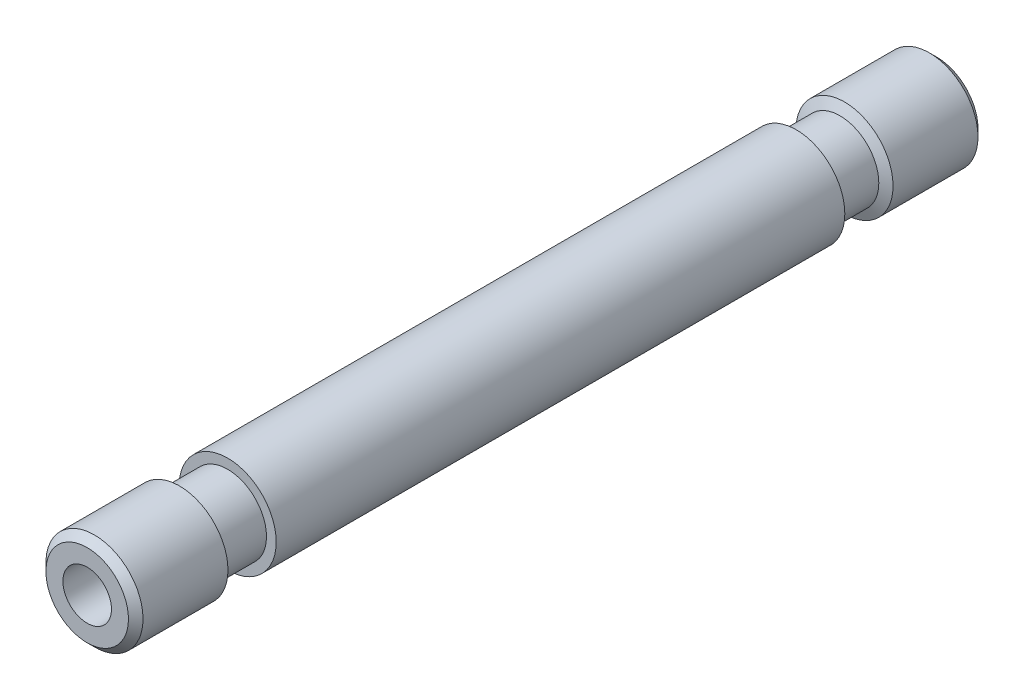
ISO-10303-21;
HEADER;
FILE_DESCRIPTION(('STEP AP214'),'2;1');
FILE_NAME('part.step','',(''),(''),'','','');
FILE_SCHEMA(('AUTOMOTIVE_DESIGN { 1 0 10303 214 1 1 1 1 }'));
ENDSEC;
DATA;
#1=APPLICATION_CONTEXT('core data for automotive mechanical design processes');
#2=APPLICATION_PROTOCOL_DEFINITION('international standard','automotive_design',2000,#1);
#3=PRODUCT_CONTEXT('',#1,'mechanical');
#4=PRODUCT('Part','Part','',(#3));
#5=PRODUCT_RELATED_PRODUCT_CATEGORY('part','',(#4));
#6=PRODUCT_DEFINITION_FORMATION('','',#4);
#7=PRODUCT_DEFINITION_CONTEXT('part definition',#1,'design');
#8=PRODUCT_DEFINITION('design','',#6,#7);
#9=PRODUCT_DEFINITION_SHAPE('','',#8);
#10=(LENGTH_UNIT() NAMED_UNIT(*) SI_UNIT(.MILLI.,.METRE.));
#11=(NAMED_UNIT(*) PLANE_ANGLE_UNIT() SI_UNIT($,.RADIAN.));
#12=(NAMED_UNIT(*) SI_UNIT($,.STERADIAN.) SOLID_ANGLE_UNIT());
#13=UNCERTAINTY_MEASURE_WITH_UNIT(LENGTH_MEASURE(1.E-05),#10,'distance_accuracy_value','');
#14=(GEOMETRIC_REPRESENTATION_CONTEXT(3) GLOBAL_UNCERTAINTY_ASSIGNED_CONTEXT((#13)) GLOBAL_UNIT_ASSIGNED_CONTEXT((#10,
#11,#12)) REPRESENTATION_CONTEXT('',''));
#15=CARTESIAN_POINT('',(0.,0.,0.));
#16=DIRECTION('',(0.,0.,1.));
#17=DIRECTION('',(1.,0.,0.));
#18=AXIS2_PLACEMENT_3D('',#15,#16,#17);
#19=CARTESIAN_POINT('',(0.,1.7,0.));
#20=DIRECTION('',(0.,0.,-1.));
#21=DIRECTION('',(-1.,0.,0.));
#22=AXIS2_PLACEMENT_3D('',#19,#20,#21);
#23=PLANE('',#22);
#24=CARTESIAN_POINT('',(0.,0.,0.));
#25=DIRECTION('',(0.,0.,1.));
#26=DIRECTION('',(1.,0.,0.));
#27=AXIS2_PLACEMENT_3D('',#24,#25,#26);
#28=CIRCLE('',#27,1.);
#29=CARTESIAN_POINT('',(1.,0.,0.));
#30=VERTEX_POINT('',#29);
#31=EDGE_CURVE('E10',#30,#30,#28,.T.);
#32=ORIENTED_EDGE('',*,*,#31,.F.);
#33=EDGE_LOOP('',(#32));
#34=FACE_BOUND('',#33,.T.);
#35=CARTESIAN_POINT('',(0.,0.,0.));
#36=DIRECTION('',(0.,0.,1.));
#37=DIRECTION('',(1.,0.,0.));
#38=AXIS2_PLACEMENT_3D('',#35,#36,#37);
#39=CIRCLE('',#38,1.7);
#40=CARTESIAN_POINT('',(1.7,0.,0.));
#41=VERTEX_POINT('',#40);
#42=EDGE_CURVE('E80',#41,#41,#39,.T.);
#43=ORIENTED_EDGE('',*,*,#42,.T.);
#44=EDGE_LOOP('',(#43));
#45=FACE_BOUND('',#44,.T.);
#46=ADVANCED_FACE('F34',(#34,#45),#23,.F.);
#47=CARTESIAN_POINT('',(0.,0.,-35.));
#48=DIRECTION('',(0.,0.,1.));
#49=DIRECTION('',(1.,0.,0.));
#50=AXIS2_PLACEMENT_3D('',#47,#48,#49);
#51=CYLINDRICAL_SURFACE('',#50,1.);
#52=CARTESIAN_POINT('',(0.,0.,-35.));
#53=DIRECTION('',(0.,0.,1.));
#54=DIRECTION('',(1.,0.,0.));
#55=AXIS2_PLACEMENT_3D('',#52,#53,#54);
#56=CIRCLE('',#55,1.);
#57=CARTESIAN_POINT('',(1.,0.,-35.));
#58=VERTEX_POINT('',#57);
#59=EDGE_CURVE('E40',#58,#58,#56,.T.);
#60=ORIENTED_EDGE('',*,*,#59,.F.);
#61=EDGE_LOOP('',(#60));
#62=FACE_BOUND('',#61,.T.);
#63=ORIENTED_EDGE('',*,*,#31,.T.);
#64=EDGE_LOOP('',(#63));
#65=FACE_BOUND('',#64,.T.);
#66=ADVANCED_FACE('F153',(#62,#65),#51,.F.);
#67=CARTESIAN_POINT('',(0.,1.,-35.));
#68=DIRECTION('',(0.,0.,1.));
#69=DIRECTION('',(1.,0.,0.));
#70=AXIS2_PLACEMENT_3D('',#67,#68,#69);
#71=PLANE('',#70);
#72=CARTESIAN_POINT('',(0.,0.,-35.));
#73=DIRECTION('',(0.,0.,1.));
#74=DIRECTION('',(1.,0.,0.));
#75=AXIS2_PLACEMENT_3D('',#72,#73,#74);
#76=CIRCLE('',#75,1.7);
#77=CARTESIAN_POINT('',(1.7,0.,-35.));
#78=VERTEX_POINT('',#77);
#79=EDGE_CURVE('E44',#78,#78,#76,.T.);
#80=ORIENTED_EDGE('',*,*,#79,.F.);
#81=EDGE_LOOP('',(#80));
#82=FACE_BOUND('',#81,.T.);
#83=ORIENTED_EDGE('',*,*,#59,.T.);
#84=EDGE_LOOP('',(#83));
#85=FACE_BOUND('',#84,.T.);
#86=ADVANCED_FACE('F148',(#82,#85),#71,.F.);
#87=CARTESIAN_POINT('',(0.,0.,-35.));
#88=DIRECTION('',(0.,0.,1.));
#89=DIRECTION('',(1.,0.,0.));
#90=AXIS2_PLACEMENT_3D('',#87,#88,#89);
#91=CONICAL_SURFACE('',#90,1.7,0.785398163397446);
#92=CARTESIAN_POINT('',(0.,0.,-34.7));
#93=DIRECTION('',(0.,0.,1.));
#94=DIRECTION('',(1.,0.,0.));
#95=AXIS2_PLACEMENT_3D('',#92,#93,#94);
#96=CIRCLE('',#95,2.);
#97=CARTESIAN_POINT('',(2.,0.,-34.7));
#98=VERTEX_POINT('',#97);
#99=EDGE_CURVE('E48',#98,#98,#96,.T.);
#100=ORIENTED_EDGE('',*,*,#99,.F.);
#101=EDGE_LOOP('',(#100));
#102=FACE_BOUND('',#101,.T.);
#103=ORIENTED_EDGE('',*,*,#79,.T.);
#104=EDGE_LOOP('',(#103));
#105=FACE_BOUND('',#104,.T.);
#106=ADVANCED_FACE('F142',(#102,#105),#91,.T.);
#107=CARTESIAN_POINT('',(0.,0.,-35.));
#108=DIRECTION('',(0.,0.,1.));
#109=DIRECTION('',(1.,0.,0.));
#110=AXIS2_PLACEMENT_3D('',#107,#108,#109);
#111=CYLINDRICAL_SURFACE('',#110,2.);
#112=CARTESIAN_POINT('',(0.,0.,-31.2));
#113=DIRECTION('',(0.,0.,1.));
#114=DIRECTION('',(1.,0.,0.));
#115=AXIS2_PLACEMENT_3D('',#112,#113,#114);
#116=CIRCLE('',#115,2.);
#117=CARTESIAN_POINT('',(2.,0.,-31.2));
#118=VERTEX_POINT('',#117);
#119=EDGE_CURVE('E53',#118,#118,#116,.T.);
#120=ORIENTED_EDGE('',*,*,#119,.F.);
#121=EDGE_LOOP('',(#120));
#122=FACE_BOUND('',#121,.T.);
#123=ORIENTED_EDGE('',*,*,#99,.T.);
#124=EDGE_LOOP('',(#123));
#125=FACE_BOUND('',#124,.T.);
#126=ADVANCED_FACE('F136',(#122,#125),#111,.T.);
#127=CARTESIAN_POINT('',(0.,0.,-31.2));
#128=DIRECTION('',(0.,0.,-1.));
#129=DIRECTION('',(-1.,0.,0.));
#130=AXIS2_PLACEMENT_3D('',#127,#128,#129);
#131=CONICAL_SURFACE('',#130,2.,1.13446401379632);
#132=CARTESIAN_POINT('',(0.,0.,-31.013476936738));
#133=DIRECTION('',(0.,0.,1.));
#134=DIRECTION('',(1.,0.,0.));
#135=AXIS2_PLACEMENT_3D('',#132,#133,#134);
#136=CIRCLE('',#135,1.6);
#137=CARTESIAN_POINT('',(1.6,0.,-31.013476936738));
#138=VERTEX_POINT('',#137);
#139=EDGE_CURVE('E56',#138,#138,#136,.T.);
#140=ORIENTED_EDGE('',*,*,#139,.F.);
#141=EDGE_LOOP('',(#140));
#142=FACE_BOUND('',#141,.T.);
#143=ORIENTED_EDGE('',*,*,#119,.T.);
#144=EDGE_LOOP('',(#143));
#145=FACE_BOUND('',#144,.T.);
#146=ADVANCED_FACE('F130',(#142,#145),#131,.T.);
#147=CARTESIAN_POINT('',(0.,0.,-35.));
#148=DIRECTION('',(0.,0.,1.));
#149=DIRECTION('',(1.,0.,0.));
#150=AXIS2_PLACEMENT_3D('',#147,#148,#149);
#151=CYLINDRICAL_SURFACE('',#150,1.6);
#152=CARTESIAN_POINT('',(0.,0.,-29.213476936738));
#153=DIRECTION('',(0.,0.,1.));
#154=DIRECTION('',(1.,0.,0.));
#155=AXIS2_PLACEMENT_3D('',#152,#153,#154);
#156=CIRCLE('',#155,1.6);
#157=CARTESIAN_POINT('',(1.6,0.,-29.213476936738));
#158=VERTEX_POINT('',#157);
#159=EDGE_CURVE('E59',#158,#158,#156,.T.);
#160=ORIENTED_EDGE('',*,*,#159,.F.);
#161=EDGE_LOOP('',(#160));
#162=FACE_BOUND('',#161,.T.);
#163=ORIENTED_EDGE('',*,*,#139,.T.);
#164=EDGE_LOOP('',(#163));
#165=FACE_BOUND('',#164,.T.);
#166=ADVANCED_FACE('F124',(#162,#165),#151,.T.);
#167=CARTESIAN_POINT('',(0.,1.6,-29.213476936738));
#168=DIRECTION('',(0.,0.,1.));
#169=DIRECTION('',(1.,0.,0.));
#170=AXIS2_PLACEMENT_3D('',#167,#168,#169);
#171=PLANE('',#170);
#172=CARTESIAN_POINT('',(0.,0.,-29.213476936738));
#173=DIRECTION('',(0.,0.,1.));
#174=DIRECTION('',(1.,0.,0.));
#175=AXIS2_PLACEMENT_3D('',#172,#173,#174);
#176=CIRCLE('',#175,2.);
#177=CARTESIAN_POINT('',(2.,0.,-29.213476936738));
#178=VERTEX_POINT('',#177);
#179=EDGE_CURVE('E62',#178,#178,#176,.T.);
#180=ORIENTED_EDGE('',*,*,#179,.F.);
#181=EDGE_LOOP('',(#180));
#182=FACE_BOUND('',#181,.T.);
#183=ORIENTED_EDGE('',*,*,#159,.T.);
#184=EDGE_LOOP('',(#183));
#185=FACE_BOUND('',#184,.T.);
#186=ADVANCED_FACE('F118',(#182,#185),#171,.F.);
#187=CARTESIAN_POINT('',(0.,0.,-35.));
#188=DIRECTION('',(0.,0.,1.));
#189=DIRECTION('',(1.,0.,0.));
#190=AXIS2_PLACEMENT_3D('',#187,#188,#189);
#191=CYLINDRICAL_SURFACE('',#190,2.);
#192=CARTESIAN_POINT('',(0.,0.,-5.786523063262));
#193=DIRECTION('',(0.,0.,1.));
#194=DIRECTION('',(1.,0.,0.));
#195=AXIS2_PLACEMENT_3D('',#192,#193,#194);
#196=CIRCLE('',#195,2.);
#197=CARTESIAN_POINT('',(2.,0.,-5.786523063262));
#198=VERTEX_POINT('',#197);
#199=EDGE_CURVE('E65',#198,#198,#196,.T.);
#200=ORIENTED_EDGE('',*,*,#199,.F.);
#201=EDGE_LOOP('',(#200));
#202=FACE_BOUND('',#201,.T.);
#203=ORIENTED_EDGE('',*,*,#179,.T.);
#204=EDGE_LOOP('',(#203));
#205=FACE_BOUND('',#204,.T.);
#206=ADVANCED_FACE('F112',(#202,#205),#191,.T.);
#207=CARTESIAN_POINT('',(0.,2.,-5.786523063262));
#208=DIRECTION('',(0.,0.,-1.));
#209=DIRECTION('',(-1.,0.,0.));
#210=AXIS2_PLACEMENT_3D('',#207,#208,#209);
#211=PLANE('',#210);
#212=CARTESIAN_POINT('',(0.,0.,-5.786523063262));
#213=DIRECTION('',(0.,0.,1.));
#214=DIRECTION('',(1.,0.,0.));
#215=AXIS2_PLACEMENT_3D('',#212,#213,#214);
#216=CIRCLE('',#215,1.6);
#217=CARTESIAN_POINT('',(1.6,0.,-5.786523063262));
#218=VERTEX_POINT('',#217);
#219=EDGE_CURVE('E68',#218,#218,#216,.T.);
#220=ORIENTED_EDGE('',*,*,#219,.F.);
#221=EDGE_LOOP('',(#220));
#222=FACE_BOUND('',#221,.T.);
#223=ORIENTED_EDGE('',*,*,#199,.T.);
#224=EDGE_LOOP('',(#223));
#225=FACE_BOUND('',#224,.T.);
#226=ADVANCED_FACE('F106',(#222,#225),#211,.F.);
#227=CARTESIAN_POINT('',(0.,0.,-35.));
#228=DIRECTION('',(0.,0.,1.));
#229=DIRECTION('',(1.,0.,0.));
#230=AXIS2_PLACEMENT_3D('',#227,#228,#229);
#231=CYLINDRICAL_SURFACE('',#230,1.6);
#232=CARTESIAN_POINT('',(0.,0.,-3.986523063262));
#233=DIRECTION('',(0.,0.,1.));
#234=DIRECTION('',(1.,0.,0.));
#235=AXIS2_PLACEMENT_3D('',#232,#233,#234);
#236=CIRCLE('',#235,1.6);
#237=CARTESIAN_POINT('',(1.6,0.,-3.986523063262));
#238=VERTEX_POINT('',#237);
#239=EDGE_CURVE('E71',#238,#238,#236,.T.);
#240=ORIENTED_EDGE('',*,*,#239,.F.);
#241=EDGE_LOOP('',(#240));
#242=FACE_BOUND('',#241,.T.);
#243=ORIENTED_EDGE('',*,*,#219,.T.);
#244=EDGE_LOOP('',(#243));
#245=FACE_BOUND('',#244,.T.);
#246=ADVANCED_FACE('F100',(#242,#245),#231,.T.);
#247=CARTESIAN_POINT('',(0.,0.,-3.986523063262));
#248=DIRECTION('',(0.,0.,1.));
#249=DIRECTION('',(1.,0.,0.));
#250=AXIS2_PLACEMENT_3D('',#247,#248,#249);
#251=CONICAL_SURFACE('',#250,1.6,1.13446401379632);
#252=CARTESIAN_POINT('',(0.,0.,-3.8));
#253=DIRECTION('',(0.,0.,1.));
#254=DIRECTION('',(1.,0.,0.));
#255=AXIS2_PLACEMENT_3D('',#252,#253,#254);
#256=CIRCLE('',#255,2.);
#257=CARTESIAN_POINT('',(2.,0.,-3.8));
#258=VERTEX_POINT('',#257);
#259=EDGE_CURVE('E74',#258,#258,#256,.T.);
#260=ORIENTED_EDGE('',*,*,#259,.F.);
#261=EDGE_LOOP('',(#260));
#262=FACE_BOUND('',#261,.T.);
#263=ORIENTED_EDGE('',*,*,#239,.T.);
#264=EDGE_LOOP('',(#263));
#265=FACE_BOUND('',#264,.T.);
#266=ADVANCED_FACE('F94',(#262,#265),#251,.T.);
#267=CARTESIAN_POINT('',(0.,0.,-35.));
#268=DIRECTION('',(0.,0.,1.));
#269=DIRECTION('',(1.,0.,0.));
#270=AXIS2_PLACEMENT_3D('',#267,#268,#269);
#271=CYLINDRICAL_SURFACE('',#270,2.);
#272=CARTESIAN_POINT('',(0.,0.,-0.300000000000002));
#273=DIRECTION('',(0.,0.,1.));
#274=DIRECTION('',(1.,0.,0.));
#275=AXIS2_PLACEMENT_3D('',#272,#273,#274);
#276=CIRCLE('',#275,2.);
#277=CARTESIAN_POINT('',(2.,0.,-0.300000000000002));
#278=VERTEX_POINT('',#277);
#279=EDGE_CURVE('E77',#278,#278,#276,.T.);
#280=ORIENTED_EDGE('',*,*,#279,.F.);
#281=EDGE_LOOP('',(#280));
#282=FACE_BOUND('',#281,.T.);
#283=ORIENTED_EDGE('',*,*,#259,.T.);
#284=EDGE_LOOP('',(#283));
#285=FACE_BOUND('',#284,.T.);
#286=ADVANCED_FACE('F88',(#282,#285),#271,.T.);
#287=CARTESIAN_POINT('',(0.,0.,-0.300000000000002));
#288=DIRECTION('',(0.,0.,-1.));
#289=DIRECTION('',(-1.,0.,0.));
#290=AXIS2_PLACEMENT_3D('',#287,#288,#289);
#291=CONICAL_SURFACE('',#290,2.,0.785398163397446);
#292=ORIENTED_EDGE('',*,*,#42,.F.);
#293=EDGE_LOOP('',(#292));
#294=FACE_BOUND('',#293,.T.);
#295=ORIENTED_EDGE('',*,*,#279,.T.);
#296=EDGE_LOOP('',(#295));
#297=FACE_BOUND('',#296,.T.);
#298=ADVANCED_FACE('F85',(#294,#297),#291,.T.);
#299=CLOSED_SHELL('',(#46,#66,#86,#106,#126,#146,#166,#186,#206,#226,#246,#266,#286,#298));
#300=MANIFOLD_SOLID_BREP('B2',#299);
#301=ADVANCED_BREP_SHAPE_REPRESENTATION('',(#18,#300),#14);
#302=SHAPE_DEFINITION_REPRESENTATION(#9,#301);
ENDSEC;
END-ISO-10303-21;
